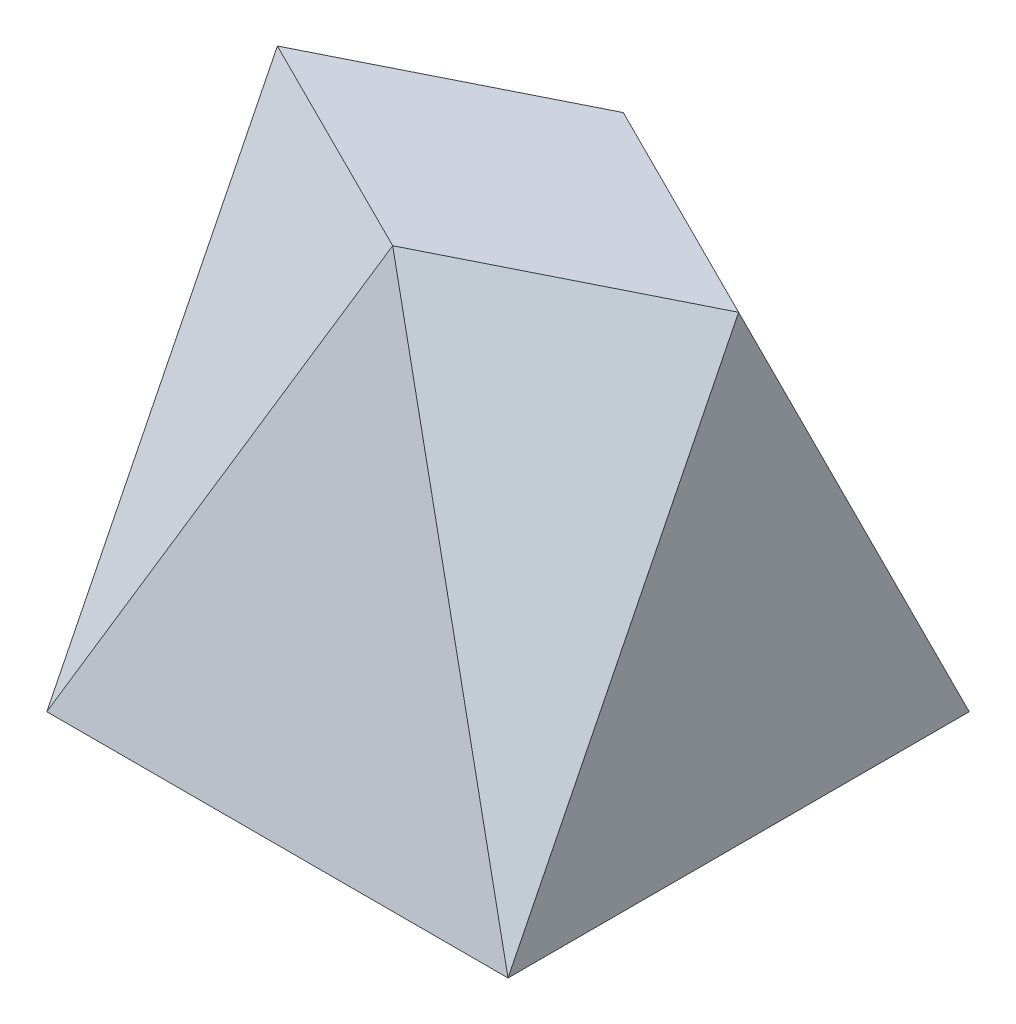
ISO-10303-21;
HEADER;
FILE_DESCRIPTION(('STEP AP214'),'2;1');
FILE_NAME('part.step','',(''),(''),'','','');
FILE_SCHEMA(('AUTOMOTIVE_DESIGN { 1 0 10303 214 1 1 1 1 }'));
ENDSEC;
DATA;
#1=APPLICATION_CONTEXT('core data for automotive mechanical design processes');
#2=APPLICATION_PROTOCOL_DEFINITION('international standard','automotive_design',2000,#1);
#3=PRODUCT_CONTEXT('',#1,'mechanical');
#4=PRODUCT('Part','Part','',(#3));
#5=PRODUCT_RELATED_PRODUCT_CATEGORY('part','',(#4));
#6=PRODUCT_DEFINITION_FORMATION('','',#4);
#7=PRODUCT_DEFINITION_CONTEXT('part definition',#1,'design');
#8=PRODUCT_DEFINITION('design','',#6,#7);
#9=PRODUCT_DEFINITION_SHAPE('','',#8);
#10=(LENGTH_UNIT() NAMED_UNIT(*) SI_UNIT(.MILLI.,.METRE.));
#11=(NAMED_UNIT(*) PLANE_ANGLE_UNIT() SI_UNIT($,.RADIAN.));
#12=(NAMED_UNIT(*) SI_UNIT($,.STERADIAN.) SOLID_ANGLE_UNIT());
#13=UNCERTAINTY_MEASURE_WITH_UNIT(LENGTH_MEASURE(1.E-05),#10,'distance_accuracy_value','');
#14=(GEOMETRIC_REPRESENTATION_CONTEXT(3) GLOBAL_UNCERTAINTY_ASSIGNED_CONTEXT((#13)) GLOBAL_UNIT_ASSIGNED_CONTEXT((#10,
#11,#12)) REPRESENTATION_CONTEXT('',''));
#15=CARTESIAN_POINT('',(0.,0.,0.));
#16=DIRECTION('',(0.,0.,1.));
#17=DIRECTION('',(1.,0.,0.));
#18=AXIS2_PLACEMENT_3D('',#15,#16,#17);
#19=CARTESIAN_POINT('',(0.,4.,0.));
#20=DIRECTION('',(0.,-1.,0.));
#21=DIRECTION('',(0.,0.,-1.));
#22=AXIS2_PLACEMENT_3D('',#19,#20,#21);
#23=PLANE('',#22);
#24=DIRECTION('',(-0.894427190999916,0.,-0.447213595499958));
#25=VECTOR('',#24,1.);
#26=CARTESIAN_POINT('',(2.,4.,0.));
#27=LINE('',#26,#25);
#28=CARTESIAN_POINT('',(2.,4.,0.));
#29=VERTEX_POINT('',#28);
#30=CARTESIAN_POINT('',(0.,4.,-1.));
#31=VERTEX_POINT('',#30);
#32=EDGE_CURVE('E83',#29,#31,#27,.T.);
#33=ORIENTED_EDGE('',*,*,#32,.T.);
#34=DIRECTION('',(-0.894427190999916,0.,0.447213595499958));
#35=VECTOR('',#34,1.);
#36=CARTESIAN_POINT('',(0.,4.,-1.));
#37=LINE('',#36,#35);
#38=CARTESIAN_POINT('',(-2.,4.,0.));
#39=VERTEX_POINT('',#38);
#40=EDGE_CURVE('E95',#31,#39,#37,.T.);
#41=ORIENTED_EDGE('',*,*,#40,.T.);
#42=DIRECTION('',(0.894427190999916,0.,0.447213595499958));
#43=VECTOR('',#42,1.);
#44=CARTESIAN_POINT('',(-2.,4.,0.));
#45=LINE('',#44,#43);
#46=CARTESIAN_POINT('',(0.,4.,1.));
#47=VERTEX_POINT('',#46);
#48=EDGE_CURVE('E114',#39,#47,#45,.T.);
#49=ORIENTED_EDGE('',*,*,#48,.T.);
#50=DIRECTION('',(-0.894427190999916,0.,0.447213595499958));
#51=VECTOR('',#50,1.);
#52=CARTESIAN_POINT('',(2.,4.,0.));
#53=LINE('',#52,#51);
#54=EDGE_CURVE('E64',#29,#47,#53,.T.);
#55=ORIENTED_EDGE('',*,*,#54,.F.);
#56=EDGE_LOOP('',(#33,#41,#49,#55));
#57=FACE_BOUND('',#56,.T.);
#58=ADVANCED_FACE('F39',(#57),#23,.F.);
#59=CARTESIAN_POINT('',(2.,4.,2.));
#60=DIRECTION('',(-1.,0.,0.));
#61=DIRECTION('',(0.,0.,1.));
#62=AXIS2_PLACEMENT_3D('',#59,#60,#61);
#63=PLANE('',#62);
#64=DIRECTION('',(0.,0.,-1.));
#65=VECTOR('',#64,1.);
#66=CARTESIAN_POINT('',(2.,0.,2.));
#67=LINE('',#66,#65);
#68=CARTESIAN_POINT('',(2.,0.,2.));
#69=VERTEX_POINT('',#68);
#70=CARTESIAN_POINT('',(2.,0.,-2.));
#71=VERTEX_POINT('',#70);
#72=EDGE_CURVE('E121',#69,#71,#67,.T.);
#73=ORIENTED_EDGE('',*,*,#72,.T.);
#74=DIRECTION('',(0.,0.894427190999916,0.447213595499958));
#75=VECTOR('',#74,1.);
#76=CARTESIAN_POINT('',(2.,0.,-2.));
#77=LINE('',#76,#75);
#78=EDGE_CURVE('E56',#71,#29,#77,.T.);
#79=ORIENTED_EDGE('',*,*,#78,.T.);
#80=DIRECTION('',(0.,0.894427190999916,-0.447213595499958));
#81=VECTOR('',#80,1.);
#82=CARTESIAN_POINT('',(2.,0.,2.));
#83=LINE('',#82,#81);
#84=EDGE_CURVE('E102',#69,#29,#83,.T.);
#85=ORIENTED_EDGE('',*,*,#84,.F.);
#86=EDGE_LOOP('',(#73,#79,#85));
#87=FACE_BOUND('',#86,.T.);
#88=ADVANCED_FACE('F41',(#87),#63,.F.);
#89=CARTESIAN_POINT('',(-2.,4.,2.));
#90=DIRECTION('',(1.,0.,0.));
#91=DIRECTION('',(0.,0.,-1.));
#92=AXIS2_PLACEMENT_3D('',#89,#90,#91);
#93=PLANE('',#92);
#94=DIRECTION('',(0.,0.894427190999916,-0.447213595499958));
#95=VECTOR('',#94,1.);
#96=CARTESIAN_POINT('',(-2.,0.,2.));
#97=LINE('',#96,#95);
#98=CARTESIAN_POINT('',(-2.,0.,2.));
#99=VERTEX_POINT('',#98);
#100=EDGE_CURVE('E116',#99,#39,#97,.T.);
#101=ORIENTED_EDGE('',*,*,#100,.T.);
#102=DIRECTION('',(0.,-0.894427190999916,-0.447213595499958));
#103=VECTOR('',#102,1.);
#104=CARTESIAN_POINT('',(-2.,4.,0.));
#105=LINE('',#104,#103);
#106=CARTESIAN_POINT('',(-2.,0.,-2.));
#107=VERTEX_POINT('',#106);
#108=EDGE_CURVE('E101',#39,#107,#105,.T.);
#109=ORIENTED_EDGE('',*,*,#108,.T.);
#110=DIRECTION('',(0.,0.,1.));
#111=VECTOR('',#110,1.);
#112=CARTESIAN_POINT('',(-2.,0.,2.));
#113=LINE('',#112,#111);
#114=EDGE_CURVE('E48',#107,#99,#113,.T.);
#115=ORIENTED_EDGE('',*,*,#114,.T.);
#116=EDGE_LOOP('',(#101,#109,#115));
#117=FACE_BOUND('',#116,.T.);
#118=ADVANCED_FACE('F144',(#117),#93,.F.);
#119=CARTESIAN_POINT('',(0.,0.,0.));
#120=DIRECTION('',(0.,-1.,0.));
#121=DIRECTION('',(0.,0.,-1.));
#122=AXIS2_PLACEMENT_3D('',#119,#120,#121);
#123=PLANE('',#122);
#124=ORIENTED_EDGE('',*,*,#72,.F.);
#125=DIRECTION('',(1.,0.,0.));
#126=VECTOR('',#125,1.);
#127=CARTESIAN_POINT('',(-2.,0.,2.));
#128=LINE('',#127,#126);
#129=EDGE_CURVE('E12',#99,#69,#128,.T.);
#130=ORIENTED_EDGE('',*,*,#129,.F.);
#131=ORIENTED_EDGE('',*,*,#114,.F.);
#132=DIRECTION('',(-1.,0.,0.));
#133=VECTOR('',#132,1.);
#134=CARTESIAN_POINT('',(-2.,0.,-2.));
#135=LINE('',#134,#133);
#136=EDGE_CURVE('E105',#71,#107,#135,.T.);
#137=ORIENTED_EDGE('',*,*,#136,.F.);
#138=EDGE_LOOP('',(#124,#130,#131,#137));
#139=FACE_BOUND('',#138,.T.);
#140=ADVANCED_FACE('F142',(#139),#123,.T.);
#141=CARTESIAN_POINT('',(-1.,1.,2.));
#142=DIRECTION('',(-0.408248290463864,0.408248290463864,0.816496580927725));
#143=DIRECTION('',(0.894427190999915,0.,0.447213595499959));
#144=AXIS2_PLACEMENT_3D('',#141,#142,#143);
#145=PLANE('',#144);
#146=DIRECTION('',(-0.436435780471985,-0.87287156094397,0.218217890235992));
#147=VECTOR('',#146,1.);
#148=CARTESIAN_POINT('',(0.,4.,1.));
#149=LINE('',#148,#147);
#150=EDGE_CURVE('E119',#47,#99,#149,.T.);
#151=ORIENTED_EDGE('',*,*,#150,.F.);
#152=ORIENTED_EDGE('',*,*,#48,.F.);
#153=ORIENTED_EDGE('',*,*,#100,.F.);
#154=EDGE_LOOP('',(#151,#152,#153));
#155=FACE_BOUND('',#154,.T.);
#156=ADVANCED_FACE('F167',(#155),#145,.T.);
#157=CARTESIAN_POINT('',(0.,0.470588235294117,1.88235294117647));
#158=DIRECTION('',(0.,0.242535625036333,0.970142500145332));
#159=DIRECTION('',(0.,-0.970142500145332,0.242535625036333));
#160=AXIS2_PLACEMENT_3D('',#157,#158,#159);
#161=PLANE('',#160);
#162=ORIENTED_EDGE('',*,*,#129,.T.);
#163=DIRECTION('',(0.436435780471985,-0.87287156094397,0.218217890235992));
#164=VECTOR('',#163,1.);
#165=CARTESIAN_POINT('',(0.,4.,1.));
#166=LINE('',#165,#164);
#167=EDGE_CURVE('E88',#47,#69,#166,.T.);
#168=ORIENTED_EDGE('',*,*,#167,.F.);
#169=ORIENTED_EDGE('',*,*,#150,.T.);
#170=EDGE_LOOP('',(#162,#168,#169));
#171=FACE_BOUND('',#170,.T.);
#172=ADVANCED_FACE('F165',(#171),#161,.T.);
#173=CARTESIAN_POINT('',(0.,0.470588235294118,-1.88235294117647));
#174=DIRECTION('',(0.,-0.242535625036333,0.970142500145332));
#175=DIRECTION('',(0.,-0.970142500145332,-0.242535625036333));
#176=AXIS2_PLACEMENT_3D('',#173,#174,#175);
#177=PLANE('',#176);
#178=ORIENTED_EDGE('',*,*,#136,.T.);
#179=DIRECTION('',(-0.436435780471985,-0.87287156094397,-0.218217890235992));
#180=VECTOR('',#179,1.);
#181=CARTESIAN_POINT('',(0.,4.,-1.));
#182=LINE('',#181,#180);
#183=EDGE_CURVE('E89',#31,#107,#182,.T.);
#184=ORIENTED_EDGE('',*,*,#183,.F.);
#185=DIRECTION('',(-0.436435780471985,0.87287156094397,0.218217890235992));
#186=VECTOR('',#185,1.);
#187=CARTESIAN_POINT('',(2.,0.,-2.));
#188=LINE('',#187,#186);
#189=EDGE_CURVE('E80',#71,#31,#188,.T.);
#190=ORIENTED_EDGE('',*,*,#189,.F.);
#191=EDGE_LOOP('',(#178,#184,#190));
#192=FACE_BOUND('',#191,.T.);
#193=ADVANCED_FACE('F104',(#192),#177,.F.);
#194=CARTESIAN_POINT('',(1.,1.,2.));
#195=DIRECTION('',(0.408248290463863,0.408248290463863,0.816496580927726));
#196=DIRECTION('',(0.,-0.894427190999916,0.447213595499958));
#197=AXIS2_PLACEMENT_3D('',#194,#195,#196);
#198=PLANE('',#197);
#199=ORIENTED_EDGE('',*,*,#84,.T.);
#200=ORIENTED_EDGE('',*,*,#54,.T.);
#201=ORIENTED_EDGE('',*,*,#167,.T.);
#202=EDGE_LOOP('',(#199,#200,#201));
#203=FACE_BOUND('',#202,.T.);
#204=ADVANCED_FACE('F162',(#203),#198,.T.);
#205=CARTESIAN_POINT('',(-0.999999999999999,0.999999999999999,-2.));
#206=DIRECTION('',(0.408248290463863,-0.408248290463863,0.816496580927726));
#207=DIRECTION('',(0.894427190999916,0.,-0.447213595499958));
#208=AXIS2_PLACEMENT_3D('',#205,#206,#207);
#209=PLANE('',#208);
#210=ORIENTED_EDGE('',*,*,#108,.F.);
#211=ORIENTED_EDGE('',*,*,#40,.F.);
#212=ORIENTED_EDGE('',*,*,#183,.T.);
#213=EDGE_LOOP('',(#210,#211,#212));
#214=FACE_BOUND('',#213,.T.);
#215=ADVANCED_FACE('F99',(#214),#209,.F.);
#216=CARTESIAN_POINT('',(1.,1.,-2.));
#217=DIRECTION('',(-0.408248290463864,-0.408248290463864,0.816496580927726));
#218=DIRECTION('',(0.894427190999916,0.,0.447213595499959));
#219=AXIS2_PLACEMENT_3D('',#216,#217,#218);
#220=PLANE('',#219);
#221=ORIENTED_EDGE('',*,*,#32,.F.);
#222=ORIENTED_EDGE('',*,*,#78,.F.);
#223=ORIENTED_EDGE('',*,*,#189,.T.);
#224=EDGE_LOOP('',(#221,#222,#223));
#225=FACE_BOUND('',#224,.T.);
#226=ADVANCED_FACE('F82',(#225),#220,.F.);
#227=CLOSED_SHELL('',(#58,#88,#118,#140,#156,#172,#193,#204,#215,#226));
#228=MANIFOLD_SOLID_BREP('B2',#227);
#229=ADVANCED_BREP_SHAPE_REPRESENTATION('',(#18,#228),#14);
#230=SHAPE_DEFINITION_REPRESENTATION(#9,#229);
ENDSEC;
END-ISO-10303-21;
